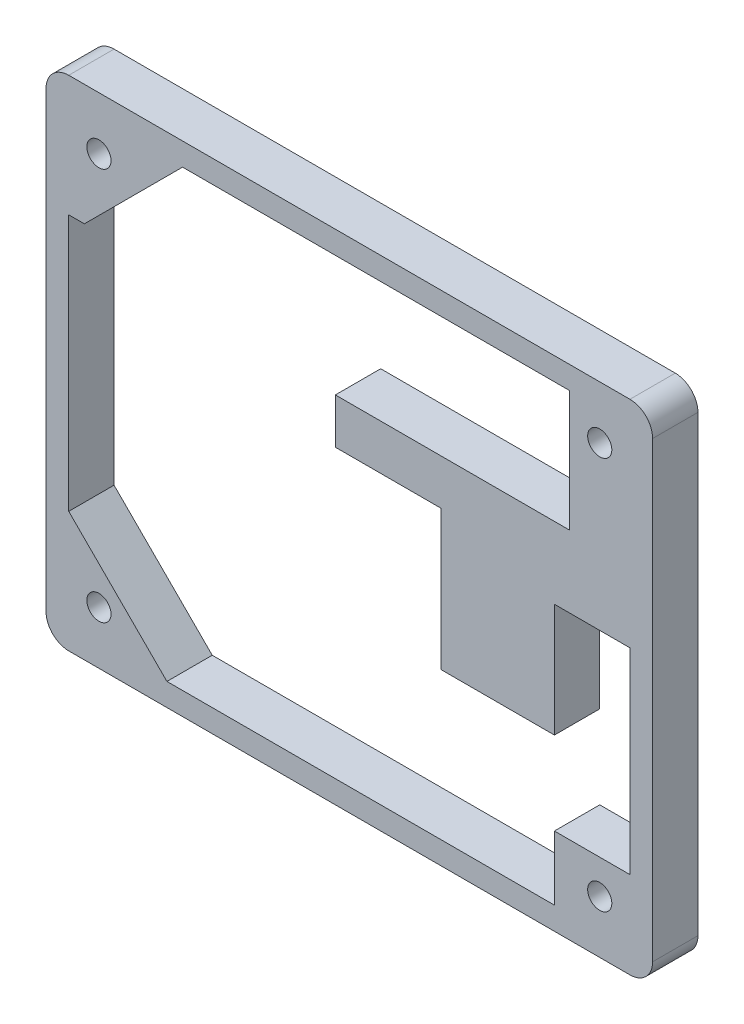
ISO-10303-21;
HEADER;
FILE_DESCRIPTION(('STEP AP214'),'2;1');
FILE_NAME('part.step','',(''),(''),'','','');
FILE_SCHEMA(('AUTOMOTIVE_DESIGN { 1 0 10303 214 1 1 1 1 }'));
ENDSEC;
DATA;
#1=APPLICATION_CONTEXT('core data for automotive mechanical design processes');
#2=APPLICATION_PROTOCOL_DEFINITION('international standard','automotive_design',2000,#1);
#3=PRODUCT_CONTEXT('',#1,'mechanical');
#4=PRODUCT('Part','Part','',(#3));
#5=PRODUCT_RELATED_PRODUCT_CATEGORY('part','',(#4));
#6=PRODUCT_DEFINITION_FORMATION('','',#4);
#7=PRODUCT_DEFINITION_CONTEXT('part definition',#1,'design');
#8=PRODUCT_DEFINITION('design','',#6,#7);
#9=PRODUCT_DEFINITION_SHAPE('','',#8);
#10=(LENGTH_UNIT() NAMED_UNIT(*) SI_UNIT(.MILLI.,.METRE.));
#11=(NAMED_UNIT(*) PLANE_ANGLE_UNIT() SI_UNIT($,.RADIAN.));
#12=(NAMED_UNIT(*) SI_UNIT($,.STERADIAN.) SOLID_ANGLE_UNIT());
#13=UNCERTAINTY_MEASURE_WITH_UNIT(LENGTH_MEASURE(1.E-05),#10,'distance_accuracy_value','');
#14=(GEOMETRIC_REPRESENTATION_CONTEXT(3) GLOBAL_UNCERTAINTY_ASSIGNED_CONTEXT((#13)) GLOBAL_UNIT_ASSIGNED_CONTEXT((#10,
#11,#12)) REPRESENTATION_CONTEXT('',''));
#15=CARTESIAN_POINT('',(0.,0.,0.));
#16=DIRECTION('',(0.,0.,1.));
#17=DIRECTION('',(1.,0.,0.));
#18=AXIS2_PLACEMENT_3D('',#15,#16,#17);
#19=CARTESIAN_POINT('',(0.,0.,6.));
#20=DIRECTION('',(1.,0.,0.));
#21=DIRECTION('',(0.,0.,-1.));
#22=AXIS2_PLACEMENT_3D('',#19,#20,#21);
#23=PLANE('',#22);
#24=DIRECTION('',(0.,-1.,0.));
#25=VECTOR('',#24,1.);
#26=CARTESIAN_POINT('',(0.,0.,0.));
#27=LINE('',#26,#25);
#28=CARTESIAN_POINT('',(0.,63.,0.));
#29=VERTEX_POINT('',#28);
#30=CARTESIAN_POINT('',(0.,3.,0.));
#31=VERTEX_POINT('',#30);
#32=EDGE_CURVE('E322',#29,#31,#27,.T.);
#33=ORIENTED_EDGE('',*,*,#32,.T.);
#34=DIRECTION('',(0.,0.,-1.));
#35=VECTOR('',#34,1.);
#36=CARTESIAN_POINT('',(0.,3.,6.));
#37=LINE('',#36,#35);
#38=CARTESIAN_POINT('',(0.,3.,6.));
#39=VERTEX_POINT('',#38);
#40=EDGE_CURVE('E11',#31,#39,#37,.F.);
#41=ORIENTED_EDGE('',*,*,#40,.T.);
#42=DIRECTION('',(0.,-1.,0.));
#43=VECTOR('',#42,1.);
#44=CARTESIAN_POINT('',(0.,0.,6.));
#45=LINE('',#44,#43);
#46=CARTESIAN_POINT('',(0.,63.,6.));
#47=VERTEX_POINT('',#46);
#48=EDGE_CURVE('E323',#47,#39,#45,.T.);
#49=ORIENTED_EDGE('',*,*,#48,.F.);
#50=DIRECTION('',(0.,0.,-1.));
#51=VECTOR('',#50,1.);
#52=CARTESIAN_POINT('',(0.,63.,6.));
#53=LINE('',#52,#51);
#54=EDGE_CURVE('E40',#47,#29,#53,.T.);
#55=ORIENTED_EDGE('',*,*,#54,.T.);
#56=EDGE_LOOP('',(#33,#41,#49,#55));
#57=FACE_BOUND('',#56,.T.);
#58=ADVANCED_FACE('F32',(#57),#23,.F.);
#59=CARTESIAN_POINT('',(0.,0.,6.));
#60=DIRECTION('',(0.,1.,0.));
#61=DIRECTION('',(0.,0.,1.));
#62=AXIS2_PLACEMENT_3D('',#59,#60,#61);
#63=PLANE('',#62);
#64=DIRECTION('',(1.,0.,0.));
#65=VECTOR('',#64,1.);
#66=CARTESIAN_POINT('',(0.,0.,0.));
#67=LINE('',#66,#65);
#68=CARTESIAN_POINT('',(3.,0.,0.));
#69=VERTEX_POINT('',#68);
#70=CARTESIAN_POINT('',(77.3,0.,0.));
#71=VERTEX_POINT('',#70);
#72=EDGE_CURVE('E339',#69,#71,#67,.T.);
#73=ORIENTED_EDGE('',*,*,#72,.T.);
#74=DIRECTION('',(0.,0.,-1.));
#75=VECTOR('',#74,1.);
#76=CARTESIAN_POINT('',(77.3,0.,6.));
#77=LINE('',#76,#75);
#78=CARTESIAN_POINT('',(77.3,0.,6.));
#79=VERTEX_POINT('',#78);
#80=EDGE_CURVE('E375',#71,#79,#77,.F.);
#81=ORIENTED_EDGE('',*,*,#80,.T.);
#82=DIRECTION('',(1.,0.,0.));
#83=VECTOR('',#82,1.);
#84=CARTESIAN_POINT('',(0.,0.,6.));
#85=LINE('',#84,#83);
#86=CARTESIAN_POINT('',(3.,0.,6.));
#87=VERTEX_POINT('',#86);
#88=EDGE_CURVE('E326',#87,#79,#85,.T.);
#89=ORIENTED_EDGE('',*,*,#88,.F.);
#90=DIRECTION('',(0.,0.,-1.));
#91=VECTOR('',#90,1.);
#92=CARTESIAN_POINT('',(3.,0.,6.));
#93=LINE('',#92,#91);
#94=EDGE_CURVE('E372',#87,#69,#93,.T.);
#95=ORIENTED_EDGE('',*,*,#94,.T.);
#96=EDGE_LOOP('',(#73,#81,#89,#95));
#97=FACE_BOUND('',#96,.T.);
#98=ADVANCED_FACE('F393',(#97),#63,.F.);
#99=CARTESIAN_POINT('',(80.3,0.,6.));
#100=DIRECTION('',(-1.,0.,0.));
#101=DIRECTION('',(0.,0.,1.));
#102=AXIS2_PLACEMENT_3D('',#99,#100,#101);
#103=PLANE('',#102);
#104=DIRECTION('',(0.,1.,0.));
#105=VECTOR('',#104,1.);
#106=CARTESIAN_POINT('',(80.3,0.,0.));
#107=LINE('',#106,#105);
#108=CARTESIAN_POINT('',(80.3,3.,0.));
#109=VERTEX_POINT('',#108);
#110=CARTESIAN_POINT('',(80.3,63.,0.));
#111=VERTEX_POINT('',#110);
#112=EDGE_CURVE('E342',#109,#111,#107,.T.);
#113=ORIENTED_EDGE('',*,*,#112,.T.);
#114=DIRECTION('',(0.,0.,-1.));
#115=VECTOR('',#114,1.);
#116=CARTESIAN_POINT('',(80.3,63.,6.));
#117=LINE('',#116,#115);
#118=CARTESIAN_POINT('',(80.3,63.,6.));
#119=VERTEX_POINT('',#118);
#120=EDGE_CURVE('E362',#111,#119,#117,.F.);
#121=ORIENTED_EDGE('',*,*,#120,.T.);
#122=DIRECTION('',(0.,1.,0.));
#123=VECTOR('',#122,1.);
#124=CARTESIAN_POINT('',(80.3,0.,6.));
#125=LINE('',#124,#123);
#126=CARTESIAN_POINT('',(80.3,3.,6.));
#127=VERTEX_POINT('',#126);
#128=EDGE_CURVE('E330',#127,#119,#125,.T.);
#129=ORIENTED_EDGE('',*,*,#128,.F.);
#130=DIRECTION('',(0.,0.,-1.));
#131=VECTOR('',#130,1.);
#132=CARTESIAN_POINT('',(80.3,3.,6.));
#133=LINE('',#132,#131);
#134=EDGE_CURVE('E359',#127,#109,#133,.T.);
#135=ORIENTED_EDGE('',*,*,#134,.T.);
#136=EDGE_LOOP('',(#113,#121,#129,#135));
#137=FACE_BOUND('',#136,.T.);
#138=ADVANCED_FACE('F404',(#137),#103,.F.);
#139=CARTESIAN_POINT('',(0.,66.,6.));
#140=DIRECTION('',(0.,-1.,0.));
#141=DIRECTION('',(0.,0.,-1.));
#142=AXIS2_PLACEMENT_3D('',#139,#140,#141);
#143=PLANE('',#142);
#144=DIRECTION('',(-1.,0.,0.));
#145=VECTOR('',#144,1.);
#146=CARTESIAN_POINT('',(0.,66.,6.));
#147=LINE('',#146,#145);
#148=CARTESIAN_POINT('',(77.3,66.,6.));
#149=VERTEX_POINT('',#148);
#150=CARTESIAN_POINT('',(3.,66.,6.));
#151=VERTEX_POINT('',#150);
#152=EDGE_CURVE('E333',#149,#151,#147,.T.);
#153=ORIENTED_EDGE('',*,*,#152,.F.);
#154=DIRECTION('',(0.,0.,-1.));
#155=VECTOR('',#154,1.);
#156=CARTESIAN_POINT('',(77.3,66.,6.));
#157=LINE('',#156,#155);
#158=CARTESIAN_POINT('',(77.3,66.,0.));
#159=VERTEX_POINT('',#158);
#160=EDGE_CURVE('E348',#149,#159,#157,.T.);
#161=ORIENTED_EDGE('',*,*,#160,.T.);
#162=DIRECTION('',(-1.,0.,0.));
#163=VECTOR('',#162,1.);
#164=CARTESIAN_POINT('',(0.,66.,0.));
#165=LINE('',#164,#163);
#166=CARTESIAN_POINT('',(3.,66.,0.));
#167=VERTEX_POINT('',#166);
#168=EDGE_CURVE('E327',#159,#167,#165,.T.);
#169=ORIENTED_EDGE('',*,*,#168,.T.);
#170=DIRECTION('',(0.,0.,-1.));
#171=VECTOR('',#170,1.);
#172=CARTESIAN_POINT('',(3.,66.,6.));
#173=LINE('',#172,#171);
#174=EDGE_CURVE('E336',#167,#151,#173,.F.);
#175=ORIENTED_EDGE('',*,*,#174,.T.);
#176=EDGE_LOOP('',(#153,#161,#169,#175));
#177=FACE_BOUND('',#176,.T.);
#178=ADVANCED_FACE('F412',(#177),#143,.F.);
#179=CARTESIAN_POINT('',(0.,0.,6.));
#180=DIRECTION('',(0.,0.,-1.));
#181=DIRECTION('',(-1.,0.,0.));
#182=AXIS2_PLACEMENT_3D('',#179,#180,#181);
#183=PLANE('',#182);
#184=DIRECTION('',(1.,0.,0.));
#185=VECTOR('',#184,1.);
#186=CARTESIAN_POINT('',(77.3,11.5,6.));
#187=LINE('',#186,#185);
#188=CARTESIAN_POINT('',(67.3,11.5,6.));
#189=VERTEX_POINT('',#188);
#190=CARTESIAN_POINT('',(77.3,11.5,6.));
#191=VERTEX_POINT('',#190);
#192=EDGE_CURVE('E239',#189,#191,#187,.T.);
#193=ORIENTED_EDGE('',*,*,#192,.F.);
#194=DIRECTION('',(0.,1.,0.));
#195=VECTOR('',#194,1.);
#196=CARTESIAN_POINT('',(67.3,11.5,6.));
#197=LINE('',#196,#195);
#198=CARTESIAN_POINT('',(67.3,3.,6.));
#199=VERTEX_POINT('',#198);
#200=EDGE_CURVE('E760',#199,#189,#197,.T.);
#201=ORIENTED_EDGE('',*,*,#200,.F.);
#202=DIRECTION('',(1.,0.,0.));
#203=VECTOR('',#202,1.);
#204=CARTESIAN_POINT('',(25.8293559072506,3.,6.));
#205=LINE('',#204,#203);
#206=CARTESIAN_POINT('',(16.0000000000002,2.99999999999999,6.));
#207=VERTEX_POINT('',#206);
#208=EDGE_CURVE('E765',#207,#199,#205,.T.);
#209=ORIENTED_EDGE('',*,*,#208,.F.);
#210=DIRECTION('',(0.707106781186552,-0.707106781186543,0.));
#211=VECTOR('',#210,1.);
#212=CARTESIAN_POINT('',(16.0000000000002,2.99999999999999,6.));
#213=LINE('',#212,#211);
#214=CARTESIAN_POINT('',(3.,16.,6.));
#215=VERTEX_POINT('',#214);
#216=EDGE_CURVE('E734',#215,#207,#213,.T.);
#217=ORIENTED_EDGE('',*,*,#216,.F.);
#218=DIRECTION('',(0.,-1.,0.));
#219=VECTOR('',#218,1.);
#220=CARTESIAN_POINT('',(3.,16.,6.));
#221=LINE('',#220,#219);
#222=CARTESIAN_POINT('',(3.,50.,6.));
#223=VERTEX_POINT('',#222);
#224=EDGE_CURVE('E278',#223,#215,#221,.T.);
#225=ORIENTED_EDGE('',*,*,#224,.F.);
#226=DIRECTION('',(-1.,0.,0.));
#227=VECTOR('',#226,1.);
#228=CARTESIAN_POINT('',(3.,50.,6.));
#229=LINE('',#228,#227);
#230=CARTESIAN_POINT('',(5.07106781186543,50.,6.));
#231=VERTEX_POINT('',#230);
#232=EDGE_CURVE('E288',#231,#223,#229,.T.);
#233=ORIENTED_EDGE('',*,*,#232,.F.);
#234=DIRECTION('',(-0.707106781186551,-0.707106781186544,0.));
#235=VECTOR('',#234,1.);
#236=CARTESIAN_POINT('',(5.07106781186543,50.,6.));
#237=LINE('',#236,#235);
#238=CARTESIAN_POINT('',(18.0710678118656,63.,6.));
#239=VERTEX_POINT('',#238);
#240=EDGE_CURVE('E725',#239,#231,#237,.T.);
#241=ORIENTED_EDGE('',*,*,#240,.F.);
#242=DIRECTION('',(-1.,0.,0.));
#243=VECTOR('',#242,1.);
#244=CARTESIAN_POINT('',(69.3,63.,6.));
#245=LINE('',#244,#243);
#246=CARTESIAN_POINT('',(69.3,63.,6.));
#247=VERTEX_POINT('',#246);
#248=EDGE_CURVE('E272',#247,#239,#245,.T.);
#249=ORIENTED_EDGE('',*,*,#248,.F.);
#250=DIRECTION('',(0.,1.,0.));
#251=VECTOR('',#250,1.);
#252=CARTESIAN_POINT('',(69.3,63.,6.));
#253=LINE('',#252,#251);
#254=CARTESIAN_POINT('',(69.3,47.,6.));
#255=VERTEX_POINT('',#254);
#256=EDGE_CURVE('E260',#255,#247,#253,.T.);
#257=ORIENTED_EDGE('',*,*,#256,.F.);
#258=DIRECTION('',(1.,0.,0.));
#259=VECTOR('',#258,1.);
#260=CARTESIAN_POINT('',(69.3,47.,6.));
#261=LINE('',#260,#259);
#262=CARTESIAN_POINT('',(38.3,47.,6.));
#263=VERTEX_POINT('',#262);
#264=EDGE_CURVE('E265',#263,#255,#261,.T.);
#265=ORIENTED_EDGE('',*,*,#264,.F.);
#266=DIRECTION('',(0.,1.,0.));
#267=VECTOR('',#266,1.);
#268=CARTESIAN_POINT('',(38.3,47.,6.));
#269=LINE('',#268,#267);
#270=CARTESIAN_POINT('',(38.3,41.,6.));
#271=VERTEX_POINT('',#270);
#272=EDGE_CURVE('E735',#271,#263,#269,.T.);
#273=ORIENTED_EDGE('',*,*,#272,.F.);
#274=DIRECTION('',(-1.,0.,0.));
#275=VECTOR('',#274,1.);
#276=CARTESIAN_POINT('',(52.3,41.,6.));
#277=LINE('',#276,#275);
#278=CARTESIAN_POINT('',(52.3,41.,6.));
#279=VERTEX_POINT('',#278);
#280=EDGE_CURVE('E253',#279,#271,#277,.T.);
#281=ORIENTED_EDGE('',*,*,#280,.F.);
#282=DIRECTION('',(0.,1.,0.));
#283=VECTOR('',#282,1.);
#284=CARTESIAN_POINT('',(52.3,41.,6.));
#285=LINE('',#284,#283);
#286=CARTESIAN_POINT('',(52.3,22.5,6.));
#287=VERTEX_POINT('',#286);
#288=EDGE_CURVE('E244',#287,#279,#285,.T.);
#289=ORIENTED_EDGE('',*,*,#288,.F.);
#290=DIRECTION('',(-1.,0.,0.));
#291=VECTOR('',#290,1.);
#292=CARTESIAN_POINT('',(25.8293559072506,22.5,6.));
#293=LINE('',#292,#291);
#294=CARTESIAN_POINT('',(67.3,22.5,6.));
#295=VERTEX_POINT('',#294);
#296=EDGE_CURVE('E773',#295,#287,#293,.T.);
#297=ORIENTED_EDGE('',*,*,#296,.F.);
#298=DIRECTION('',(0.,-1.,0.));
#299=VECTOR('',#298,1.);
#300=CARTESIAN_POINT('',(67.3,37.5,6.));
#301=LINE('',#300,#299);
#302=CARTESIAN_POINT('',(67.3,37.5,6.));
#303=VERTEX_POINT('',#302);
#304=EDGE_CURVE('E215',#303,#295,#301,.T.);
#305=ORIENTED_EDGE('',*,*,#304,.F.);
#306=DIRECTION('',(-1.,0.,0.));
#307=VECTOR('',#306,1.);
#308=CARTESIAN_POINT('',(77.3,37.5,6.));
#309=LINE('',#308,#307);
#310=CARTESIAN_POINT('',(77.3,37.5,6.));
#311=VERTEX_POINT('',#310);
#312=EDGE_CURVE('E235',#311,#303,#309,.T.);
#313=ORIENTED_EDGE('',*,*,#312,.F.);
#314=DIRECTION('',(0.,1.,0.));
#315=VECTOR('',#314,1.);
#316=CARTESIAN_POINT('',(77.3,37.5,6.));
#317=LINE('',#316,#315);
#318=EDGE_CURVE('E55',#191,#311,#317,.T.);
#319=ORIENTED_EDGE('',*,*,#318,.F.);
#320=EDGE_LOOP('',(#193,#201,#209,#217,#225,#233,#241,#249,#257,#265,#273,#281,#289,#297,#305,
#313,#319));
#321=FACE_BOUND('',#320,.T.);
#322=CARTESIAN_POINT('',(7.,59.,6.));
#323=DIRECTION('',(0.,0.,1.));
#324=DIRECTION('',(1.,0.,0.));
#325=AXIS2_PLACEMENT_3D('',#322,#323,#324);
#326=CIRCLE('',#325,1.59999999999999);
#327=CARTESIAN_POINT('',(8.59999999999999,59.,6.));
#328=VERTEX_POINT('',#327);
#329=EDGE_CURVE('E297',#328,#328,#326,.T.);
#330=ORIENTED_EDGE('',*,*,#329,.F.);
#331=EDGE_LOOP('',(#330));
#332=FACE_BOUND('',#331,.T.);
#333=CARTESIAN_POINT('',(73.3,59.,6.));
#334=DIRECTION('',(0.,0.,1.));
#335=DIRECTION('',(1.,0.,0.));
#336=AXIS2_PLACEMENT_3D('',#333,#334,#335);
#337=CIRCLE('',#336,1.59999999999999);
#338=CARTESIAN_POINT('',(74.9,59.,6.));
#339=VERTEX_POINT('',#338);
#340=EDGE_CURVE('E304',#339,#339,#337,.T.);
#341=ORIENTED_EDGE('',*,*,#340,.F.);
#342=EDGE_LOOP('',(#341));
#343=FACE_BOUND('',#342,.T.);
#344=CARTESIAN_POINT('',(73.3,7.,6.));
#345=DIRECTION('',(0.,0.,1.));
#346=DIRECTION('',(1.,0.,0.));
#347=AXIS2_PLACEMENT_3D('',#344,#345,#346);
#348=CIRCLE('',#347,1.59999999999999);
#349=CARTESIAN_POINT('',(74.9,7.,6.));
#350=VERTEX_POINT('',#349);
#351=EDGE_CURVE('E310',#350,#350,#348,.T.);
#352=ORIENTED_EDGE('',*,*,#351,.F.);
#353=EDGE_LOOP('',(#352));
#354=FACE_BOUND('',#353,.T.);
#355=CARTESIAN_POINT('',(7.00000000000001,7.,6.));
#356=DIRECTION('',(0.,0.,1.));
#357=DIRECTION('',(1.,0.,0.));
#358=AXIS2_PLACEMENT_3D('',#355,#356,#357);
#359=CIRCLE('',#358,1.59999999999999);
#360=CARTESIAN_POINT('',(8.59999999999999,7.,6.));
#361=VERTEX_POINT('',#360);
#362=EDGE_CURVE('E316',#361,#361,#359,.T.);
#363=ORIENTED_EDGE('',*,*,#362,.F.);
#364=EDGE_LOOP('',(#363));
#365=FACE_BOUND('',#364,.T.);
#366=ORIENTED_EDGE('',*,*,#128,.T.);
#367=CARTESIAN_POINT('',(77.3,63.,6.));
#368=DIRECTION('',(0.,0.,-1.));
#369=DIRECTION('',(-1.,0.,0.));
#370=AXIS2_PLACEMENT_3D('',#367,#368,#369);
#371=CIRCLE('',#370,3.);
#372=EDGE_CURVE('E370',#119,#149,#371,.F.);
#373=ORIENTED_EDGE('',*,*,#372,.T.);
#374=ORIENTED_EDGE('',*,*,#152,.T.);
#375=CARTESIAN_POINT('',(3.,63.,6.));
#376=DIRECTION('',(0.,0.,-1.));
#377=DIRECTION('',(-1.,0.,0.));
#378=AXIS2_PLACEMENT_3D('',#375,#376,#377);
#379=CIRCLE('',#378,3.);
#380=EDGE_CURVE('E364',#151,#47,#379,.F.);
#381=ORIENTED_EDGE('',*,*,#380,.T.);
#382=ORIENTED_EDGE('',*,*,#48,.T.);
#383=CARTESIAN_POINT('',(3.,3.,6.));
#384=DIRECTION('',(0.,0.,-1.));
#385=DIRECTION('',(-1.,0.,0.));
#386=AXIS2_PLACEMENT_3D('',#383,#384,#385);
#387=CIRCLE('',#386,3.);
#388=EDGE_CURVE('E366',#39,#87,#387,.F.);
#389=ORIENTED_EDGE('',*,*,#388,.T.);
#390=ORIENTED_EDGE('',*,*,#88,.T.);
#391=CARTESIAN_POINT('',(77.3,3.,6.));
#392=DIRECTION('',(0.,0.,-1.));
#393=DIRECTION('',(-1.,0.,0.));
#394=AXIS2_PLACEMENT_3D('',#391,#392,#393);
#395=CIRCLE('',#394,3.);
#396=EDGE_CURVE('E368',#79,#127,#395,.F.);
#397=ORIENTED_EDGE('',*,*,#396,.T.);
#398=EDGE_LOOP('',(#366,#373,#374,#381,#382,#389,#390,#397));
#399=FACE_BOUND('',#398,.T.);
#400=ADVANCED_FACE('F397',(#321,#332,#343,#354,#365,#399),#183,.F.);
#401=CARTESIAN_POINT('',(0.,0.,0.));
#402=DIRECTION('',(0.,0.,-1.));
#403=DIRECTION('',(-1.,0.,0.));
#404=AXIS2_PLACEMENT_3D('',#401,#402,#403);
#405=PLANE('',#404);
#406=DIRECTION('',(0.,1.,0.));
#407=VECTOR('',#406,1.);
#408=CARTESIAN_POINT('',(67.3,22.5,0.));
#409=LINE('',#408,#407);
#410=CARTESIAN_POINT('',(67.3,3.,0.));
#411=VERTEX_POINT('',#410);
#412=CARTESIAN_POINT('',(67.3,11.5,0.));
#413=VERTEX_POINT('',#412);
#414=EDGE_CURVE('E754',#411,#413,#409,.T.);
#415=ORIENTED_EDGE('',*,*,#414,.T.);
#416=DIRECTION('',(1.,0.,0.));
#417=VECTOR('',#416,1.);
#418=CARTESIAN_POINT('',(77.3,11.5,0.));
#419=LINE('',#418,#417);
#420=CARTESIAN_POINT('',(77.3,11.5,0.));
#421=VERTEX_POINT('',#420);
#422=EDGE_CURVE('E225',#413,#421,#419,.T.);
#423=ORIENTED_EDGE('',*,*,#422,.T.);
#424=DIRECTION('',(0.,1.,0.));
#425=VECTOR('',#424,1.);
#426=CARTESIAN_POINT('',(77.3,37.5,0.));
#427=LINE('',#426,#425);
#428=CARTESIAN_POINT('',(77.3,37.5,0.));
#429=VERTEX_POINT('',#428);
#430=EDGE_CURVE('E230',#421,#429,#427,.T.);
#431=ORIENTED_EDGE('',*,*,#430,.T.);
#432=DIRECTION('',(-1.,0.,0.));
#433=VECTOR('',#432,1.);
#434=CARTESIAN_POINT('',(77.3,37.5,0.));
#435=LINE('',#434,#433);
#436=CARTESIAN_POINT('',(67.3,37.5,0.));
#437=VERTEX_POINT('',#436);
#438=EDGE_CURVE('E224',#429,#437,#435,.T.);
#439=ORIENTED_EDGE('',*,*,#438,.T.);
#440=DIRECTION('',(0.,-1.,0.));
#441=VECTOR('',#440,1.);
#442=CARTESIAN_POINT('',(67.3,37.5,0.));
#443=LINE('',#442,#441);
#444=CARTESIAN_POINT('',(67.3,22.5,0.));
#445=VERTEX_POINT('',#444);
#446=EDGE_CURVE('E212',#437,#445,#443,.T.);
#447=ORIENTED_EDGE('',*,*,#446,.T.);
#448=DIRECTION('',(-1.,0.,0.));
#449=VECTOR('',#448,1.);
#450=CARTESIAN_POINT('',(25.8293559072506,22.5,0.));
#451=LINE('',#450,#449);
#452=CARTESIAN_POINT('',(52.3,22.5,0.));
#453=VERTEX_POINT('',#452);
#454=EDGE_CURVE('E199',#445,#453,#451,.T.);
#455=ORIENTED_EDGE('',*,*,#454,.T.);
#456=DIRECTION('',(0.,1.,0.));
#457=VECTOR('',#456,1.);
#458=CARTESIAN_POINT('',(52.3,41.,0.));
#459=LINE('',#458,#457);
#460=CARTESIAN_POINT('',(52.3,41.,0.));
#461=VERTEX_POINT('',#460);
#462=EDGE_CURVE('E47',#453,#461,#459,.T.);
#463=ORIENTED_EDGE('',*,*,#462,.T.);
#464=DIRECTION('',(-1.,0.,0.));
#465=VECTOR('',#464,1.);
#466=CARTESIAN_POINT('',(52.3,41.,0.));
#467=LINE('',#466,#465);
#468=CARTESIAN_POINT('',(38.3,41.,0.));
#469=VERTEX_POINT('',#468);
#470=EDGE_CURVE('E252',#461,#469,#467,.T.);
#471=ORIENTED_EDGE('',*,*,#470,.T.);
#472=DIRECTION('',(0.,1.,0.));
#473=VECTOR('',#472,1.);
#474=CARTESIAN_POINT('',(38.3,47.,0.));
#475=LINE('',#474,#473);
#476=CARTESIAN_POINT('',(38.3,47.,0.));
#477=VERTEX_POINT('',#476);
#478=EDGE_CURVE('E750',#469,#477,#475,.T.);
#479=ORIENTED_EDGE('',*,*,#478,.T.);
#480=DIRECTION('',(1.,0.,0.));
#481=VECTOR('',#480,1.);
#482=CARTESIAN_POINT('',(69.3,47.,0.));
#483=LINE('',#482,#481);
#484=CARTESIAN_POINT('',(69.3,47.,0.));
#485=VERTEX_POINT('',#484);
#486=EDGE_CURVE('E267',#477,#485,#483,.T.);
#487=ORIENTED_EDGE('',*,*,#486,.T.);
#488=DIRECTION('',(0.,1.,0.));
#489=VECTOR('',#488,1.);
#490=CARTESIAN_POINT('',(69.3,63.,0.));
#491=LINE('',#490,#489);
#492=CARTESIAN_POINT('',(69.3,63.,0.));
#493=VERTEX_POINT('',#492);
#494=EDGE_CURVE('E261',#485,#493,#491,.T.);
#495=ORIENTED_EDGE('',*,*,#494,.T.);
#496=DIRECTION('',(-1.,0.,0.));
#497=VECTOR('',#496,1.);
#498=CARTESIAN_POINT('',(69.3,63.,0.));
#499=LINE('',#498,#497);
#500=CARTESIAN_POINT('',(18.0710678118656,63.,0.));
#501=VERTEX_POINT('',#500);
#502=EDGE_CURVE('E264',#493,#501,#499,.T.);
#503=ORIENTED_EDGE('',*,*,#502,.T.);
#504=DIRECTION('',(-0.707106781186551,-0.707106781186544,0.));
#505=VECTOR('',#504,1.);
#506=CARTESIAN_POINT('',(5.07106781186543,50.,0.));
#507=LINE('',#506,#505);
#508=CARTESIAN_POINT('',(5.07106781186543,50.,0.));
#509=VERTEX_POINT('',#508);
#510=EDGE_CURVE('E748',#501,#509,#507,.T.);
#511=ORIENTED_EDGE('',*,*,#510,.T.);
#512=DIRECTION('',(-1.,0.,0.));
#513=VECTOR('',#512,1.);
#514=CARTESIAN_POINT('',(3.,50.,0.));
#515=LINE('',#514,#513);
#516=CARTESIAN_POINT('',(3.,50.,0.));
#517=VERTEX_POINT('',#516);
#518=EDGE_CURVE('E287',#509,#517,#515,.T.);
#519=ORIENTED_EDGE('',*,*,#518,.T.);
#520=DIRECTION('',(0.,-1.,0.));
#521=VECTOR('',#520,1.);
#522=CARTESIAN_POINT('',(3.,16.,0.));
#523=LINE('',#522,#521);
#524=CARTESIAN_POINT('',(3.,16.,0.));
#525=VERTEX_POINT('',#524);
#526=EDGE_CURVE('E284',#517,#525,#523,.T.);
#527=ORIENTED_EDGE('',*,*,#526,.T.);
#528=DIRECTION('',(0.707106781186552,-0.707106781186543,0.));
#529=VECTOR('',#528,1.);
#530=CARTESIAN_POINT('',(16.0000000000002,2.99999999999999,0.));
#531=LINE('',#530,#529);
#532=CARTESIAN_POINT('',(16.0000000000002,2.99999999999999,0.));
#533=VERTEX_POINT('',#532);
#534=EDGE_CURVE('E216',#525,#533,#531,.T.);
#535=ORIENTED_EDGE('',*,*,#534,.T.);
#536=DIRECTION('',(1.,0.,0.));
#537=VECTOR('',#536,1.);
#538=CARTESIAN_POINT('',(25.8293559072506,3.,0.));
#539=LINE('',#538,#537);
#540=EDGE_CURVE('E208',#533,#411,#539,.T.);
#541=ORIENTED_EDGE('',*,*,#540,.T.);
#542=EDGE_LOOP('',(#415,#423,#431,#439,#447,#455,#463,#471,#479,#487,#495,#503,#511,#519,#527,
#535,#541));
#543=FACE_BOUND('',#542,.T.);
#544=CARTESIAN_POINT('',(7.,59.,0.));
#545=DIRECTION('',(0.,0.,1.));
#546=DIRECTION('',(1.,0.,0.));
#547=AXIS2_PLACEMENT_3D('',#544,#545,#546);
#548=CIRCLE('',#547,1.6);
#549=CARTESIAN_POINT('',(8.6,59.,0.));
#550=VERTEX_POINT('',#549);
#551=EDGE_CURVE('E301',#550,#550,#548,.T.);
#552=ORIENTED_EDGE('',*,*,#551,.T.);
#553=EDGE_LOOP('',(#552));
#554=FACE_BOUND('',#553,.T.);
#555=CARTESIAN_POINT('',(73.3,59.,0.));
#556=DIRECTION('',(0.,0.,1.));
#557=DIRECTION('',(1.,0.,0.));
#558=AXIS2_PLACEMENT_3D('',#555,#556,#557);
#559=CIRCLE('',#558,1.6);
#560=CARTESIAN_POINT('',(74.9,59.,0.));
#561=VERTEX_POINT('',#560);
#562=EDGE_CURVE('E307',#561,#561,#559,.T.);
#563=ORIENTED_EDGE('',*,*,#562,.T.);
#564=EDGE_LOOP('',(#563));
#565=FACE_BOUND('',#564,.T.);
#566=CARTESIAN_POINT('',(73.3,7.,0.));
#567=DIRECTION('',(0.,0.,1.));
#568=DIRECTION('',(1.,0.,0.));
#569=AXIS2_PLACEMENT_3D('',#566,#567,#568);
#570=CIRCLE('',#569,1.6);
#571=CARTESIAN_POINT('',(74.9,7.,0.));
#572=VERTEX_POINT('',#571);
#573=EDGE_CURVE('E313',#572,#572,#570,.T.);
#574=ORIENTED_EDGE('',*,*,#573,.T.);
#575=EDGE_LOOP('',(#574));
#576=FACE_BOUND('',#575,.T.);
#577=CARTESIAN_POINT('',(7.00000000000001,7.,0.));
#578=DIRECTION('',(0.,0.,1.));
#579=DIRECTION('',(1.,0.,0.));
#580=AXIS2_PLACEMENT_3D('',#577,#578,#579);
#581=CIRCLE('',#580,1.6);
#582=CARTESIAN_POINT('',(8.6,7.,0.));
#583=VERTEX_POINT('',#582);
#584=EDGE_CURVE('E319',#583,#583,#581,.T.);
#585=ORIENTED_EDGE('',*,*,#584,.T.);
#586=EDGE_LOOP('',(#585));
#587=FACE_BOUND('',#586,.T.);
#588=ORIENTED_EDGE('',*,*,#168,.F.);
#589=CARTESIAN_POINT('',(77.3,63.,0.));
#590=DIRECTION('',(0.,0.,-1.));
#591=DIRECTION('',(-1.,0.,0.));
#592=AXIS2_PLACEMENT_3D('',#589,#590,#591);
#593=CIRCLE('',#592,3.);
#594=EDGE_CURVE('E357',#159,#111,#593,.T.);
#595=ORIENTED_EDGE('',*,*,#594,.T.);
#596=ORIENTED_EDGE('',*,*,#112,.F.);
#597=CARTESIAN_POINT('',(77.3,3.,0.));
#598=DIRECTION('',(0.,0.,-1.));
#599=DIRECTION('',(-1.,0.,0.));
#600=AXIS2_PLACEMENT_3D('',#597,#598,#599);
#601=CIRCLE('',#600,3.);
#602=EDGE_CURVE('E355',#109,#71,#601,.T.);
#603=ORIENTED_EDGE('',*,*,#602,.T.);
#604=ORIENTED_EDGE('',*,*,#72,.F.);
#605=CARTESIAN_POINT('',(3.,3.,0.));
#606=DIRECTION('',(0.,0.,-1.));
#607=DIRECTION('',(-1.,0.,0.));
#608=AXIS2_PLACEMENT_3D('',#605,#606,#607);
#609=CIRCLE('',#608,3.);
#610=EDGE_CURVE('E353',#69,#31,#609,.T.);
#611=ORIENTED_EDGE('',*,*,#610,.T.);
#612=ORIENTED_EDGE('',*,*,#32,.F.);
#613=CARTESIAN_POINT('',(3.,63.,0.));
#614=DIRECTION('',(0.,0.,-1.));
#615=DIRECTION('',(-1.,0.,0.));
#616=AXIS2_PLACEMENT_3D('',#613,#614,#615);
#617=CIRCLE('',#616,3.);
#618=EDGE_CURVE('E351',#29,#167,#617,.T.);
#619=ORIENTED_EDGE('',*,*,#618,.T.);
#620=EDGE_LOOP('',(#588,#595,#596,#603,#604,#611,#612,#619));
#621=FACE_BOUND('',#620,.T.);
#622=ADVANCED_FACE('F220',(#543,#554,#565,#576,#587,#621),#405,.T.);
#623=CARTESIAN_POINT('',(7.00000000000001,7.,6.));
#624=DIRECTION('',(0.,0.,1.));
#625=DIRECTION('',(1.,0.,0.));
#626=AXIS2_PLACEMENT_3D('',#623,#624,#625);
#627=CYLINDRICAL_SURFACE('',#626,1.59999999999999);
#628=ORIENTED_EDGE('',*,*,#584,.F.);
#629=EDGE_LOOP('',(#628));
#630=FACE_BOUND('',#629,.T.);
#631=ORIENTED_EDGE('',*,*,#362,.T.);
#632=EDGE_LOOP('',(#631));
#633=FACE_BOUND('',#632,.T.);
#634=ADVANCED_FACE('F513',(#630,#633),#627,.F.);
#635=CARTESIAN_POINT('',(73.3,7.,6.));
#636=DIRECTION('',(0.,0.,1.));
#637=DIRECTION('',(1.,0.,0.));
#638=AXIS2_PLACEMENT_3D('',#635,#636,#637);
#639=CYLINDRICAL_SURFACE('',#638,1.6);
#640=ORIENTED_EDGE('',*,*,#573,.F.);
#641=EDGE_LOOP('',(#640));
#642=FACE_BOUND('',#641,.T.);
#643=ORIENTED_EDGE('',*,*,#351,.T.);
#644=EDGE_LOOP('',(#643));
#645=FACE_BOUND('',#644,.T.);
#646=ADVANCED_FACE('F646',(#642,#645),#639,.F.);
#647=CARTESIAN_POINT('',(73.3,59.,6.));
#648=DIRECTION('',(0.,0.,1.));
#649=DIRECTION('',(1.,0.,0.));
#650=AXIS2_PLACEMENT_3D('',#647,#648,#649);
#651=CYLINDRICAL_SURFACE('',#650,1.6);
#652=ORIENTED_EDGE('',*,*,#562,.F.);
#653=EDGE_LOOP('',(#652));
#654=FACE_BOUND('',#653,.T.);
#655=ORIENTED_EDGE('',*,*,#340,.T.);
#656=EDGE_LOOP('',(#655));
#657=FACE_BOUND('',#656,.T.);
#658=ADVANCED_FACE('F642',(#654,#657),#651,.F.);
#659=CARTESIAN_POINT('',(7.,59.,6.));
#660=DIRECTION('',(0.,0.,1.));
#661=DIRECTION('',(1.,0.,0.));
#662=AXIS2_PLACEMENT_3D('',#659,#660,#661);
#663=CYLINDRICAL_SURFACE('',#662,1.59999999999999);
#664=ORIENTED_EDGE('',*,*,#551,.F.);
#665=EDGE_LOOP('',(#664));
#666=FACE_BOUND('',#665,.T.);
#667=ORIENTED_EDGE('',*,*,#329,.T.);
#668=EDGE_LOOP('',(#667));
#669=FACE_BOUND('',#668,.T.);
#670=ADVANCED_FACE('F433',(#666,#669),#663,.F.);
#671=CARTESIAN_POINT('',(77.3,63.,6.));
#672=DIRECTION('',(0.,0.,-1.));
#673=DIRECTION('',(-1.,0.,0.));
#674=AXIS2_PLACEMENT_3D('',#671,#672,#673);
#675=CYLINDRICAL_SURFACE('',#674,3.);
#676=ORIENTED_EDGE('',*,*,#372,.F.);
#677=ORIENTED_EDGE('',*,*,#120,.F.);
#678=ORIENTED_EDGE('',*,*,#594,.F.);
#679=ORIENTED_EDGE('',*,*,#160,.F.);
#680=EDGE_LOOP('',(#676,#677,#678,#679));
#681=FACE_BOUND('',#680,.T.);
#682=ADVANCED_FACE('F409',(#681),#675,.T.);
#683=CARTESIAN_POINT('',(77.3,3.,6.));
#684=DIRECTION('',(0.,0.,-1.));
#685=DIRECTION('',(-1.,0.,0.));
#686=AXIS2_PLACEMENT_3D('',#683,#684,#685);
#687=CYLINDRICAL_SURFACE('',#686,3.);
#688=ORIENTED_EDGE('',*,*,#396,.F.);
#689=ORIENTED_EDGE('',*,*,#80,.F.);
#690=ORIENTED_EDGE('',*,*,#602,.F.);
#691=ORIENTED_EDGE('',*,*,#134,.F.);
#692=EDGE_LOOP('',(#688,#689,#690,#691));
#693=FACE_BOUND('',#692,.T.);
#694=ADVANCED_FACE('F401',(#693),#687,.T.);
#695=CARTESIAN_POINT('',(3.,3.,6.));
#696=DIRECTION('',(0.,0.,-1.));
#697=DIRECTION('',(-1.,0.,0.));
#698=AXIS2_PLACEMENT_3D('',#695,#696,#697);
#699=CYLINDRICAL_SURFACE('',#698,3.);
#700=ORIENTED_EDGE('',*,*,#388,.F.);
#701=ORIENTED_EDGE('',*,*,#40,.F.);
#702=ORIENTED_EDGE('',*,*,#610,.F.);
#703=ORIENTED_EDGE('',*,*,#94,.F.);
#704=EDGE_LOOP('',(#700,#701,#702,#703));
#705=FACE_BOUND('',#704,.T.);
#706=ADVANCED_FACE('F390',(#705),#699,.T.);
#707=CARTESIAN_POINT('',(3.,63.,6.));
#708=DIRECTION('',(0.,0.,-1.));
#709=DIRECTION('',(-1.,0.,0.));
#710=AXIS2_PLACEMENT_3D('',#707,#708,#709);
#711=CYLINDRICAL_SURFACE('',#710,3.);
#712=ORIENTED_EDGE('',*,*,#380,.F.);
#713=ORIENTED_EDGE('',*,*,#174,.F.);
#714=ORIENTED_EDGE('',*,*,#618,.F.);
#715=ORIENTED_EDGE('',*,*,#54,.F.);
#716=EDGE_LOOP('',(#712,#713,#714,#715));
#717=FACE_BOUND('',#716,.T.);
#718=ADVANCED_FACE('F34',(#717),#711,.T.);
#719=CARTESIAN_POINT('',(3.,16.,0.));
#720=DIRECTION('',(-1.,0.,0.));
#721=DIRECTION('',(0.,0.,1.));
#722=AXIS2_PLACEMENT_3D('',#719,#720,#721);
#723=PLANE('',#722);
#724=ORIENTED_EDGE('',*,*,#224,.T.);
#725=DIRECTION('',(0.,0.,1.));
#726=VECTOR('',#725,1.);
#727=CARTESIAN_POINT('',(3.,16.,0.));
#728=LINE('',#727,#726);
#729=EDGE_CURVE('E290',#525,#215,#728,.T.);
#730=ORIENTED_EDGE('',*,*,#729,.F.);
#731=ORIENTED_EDGE('',*,*,#526,.F.);
#732=DIRECTION('',(0.,0.,1.));
#733=VECTOR('',#732,1.);
#734=CARTESIAN_POINT('',(3.,50.,0.));
#735=LINE('',#734,#733);
#736=EDGE_CURVE('E294',#517,#223,#735,.T.);
#737=ORIENTED_EDGE('',*,*,#736,.T.);
#738=EDGE_LOOP('',(#724,#730,#731,#737));
#739=FACE_BOUND('',#738,.T.);
#740=ADVANCED_FACE('F415',(#739),#723,.F.);
#741=CARTESIAN_POINT('',(3.,50.,0.));
#742=DIRECTION('',(0.,1.,0.));
#743=DIRECTION('',(0.,0.,1.));
#744=AXIS2_PLACEMENT_3D('',#741,#742,#743);
#745=PLANE('',#744);
#746=ORIENTED_EDGE('',*,*,#518,.F.);
#747=DIRECTION('',(0.,0.,1.));
#748=VECTOR('',#747,1.);
#749=CARTESIAN_POINT('',(5.07106781186543,50.,0.));
#750=LINE('',#749,#748);
#751=EDGE_CURVE('E728',#509,#231,#750,.T.);
#752=ORIENTED_EDGE('',*,*,#751,.T.);
#753=ORIENTED_EDGE('',*,*,#232,.T.);
#754=ORIENTED_EDGE('',*,*,#736,.F.);
#755=EDGE_LOOP('',(#746,#752,#753,#754));
#756=FACE_BOUND('',#755,.T.);
#757=ADVANCED_FACE('F420',(#756),#745,.F.);
#758=CARTESIAN_POINT('',(69.3,63.,0.));
#759=DIRECTION('',(1.,0.,0.));
#760=DIRECTION('',(0.,1.,0.));
#761=AXIS2_PLACEMENT_3D('',#758,#759,#760);
#762=PLANE('',#761);
#763=ORIENTED_EDGE('',*,*,#256,.T.);
#764=DIRECTION('',(0.,0.,1.));
#765=VECTOR('',#764,1.);
#766=CARTESIAN_POINT('',(69.3,63.,0.));
#767=LINE('',#766,#765);
#768=EDGE_CURVE('E270',#493,#247,#767,.T.);
#769=ORIENTED_EDGE('',*,*,#768,.F.);
#770=ORIENTED_EDGE('',*,*,#494,.F.);
#771=DIRECTION('',(0.,0.,1.));
#772=VECTOR('',#771,1.);
#773=CARTESIAN_POINT('',(69.3,47.,0.));
#774=LINE('',#773,#772);
#775=EDGE_CURVE('E276',#485,#255,#774,.T.);
#776=ORIENTED_EDGE('',*,*,#775,.T.);
#777=EDGE_LOOP('',(#763,#769,#770,#776));
#778=FACE_BOUND('',#777,.T.);
#779=ADVANCED_FACE('F454',(#778),#762,.F.);
#780=CARTESIAN_POINT('',(69.3,47.,0.));
#781=DIRECTION('',(0.,-1.,0.));
#782=DIRECTION('',(1.,0.,0.));
#783=AXIS2_PLACEMENT_3D('',#780,#781,#782);
#784=PLANE('',#783);
#785=ORIENTED_EDGE('',*,*,#264,.T.);
#786=ORIENTED_EDGE('',*,*,#775,.F.);
#787=ORIENTED_EDGE('',*,*,#486,.F.);
#788=DIRECTION('',(0.,0.,1.));
#789=VECTOR('',#788,1.);
#790=CARTESIAN_POINT('',(38.3,47.,0.));
#791=LINE('',#790,#789);
#792=EDGE_CURVE('E279',#477,#263,#791,.T.);
#793=ORIENTED_EDGE('',*,*,#792,.T.);
#794=EDGE_LOOP('',(#785,#786,#787,#793));
#795=FACE_BOUND('',#794,.T.);
#796=ADVANCED_FACE('F459',(#795),#784,.F.);
#797=CARTESIAN_POINT('',(69.3,63.,0.));
#798=DIRECTION('',(0.,1.,0.));
#799=DIRECTION('',(0.,0.,1.));
#800=AXIS2_PLACEMENT_3D('',#797,#798,#799);
#801=PLANE('',#800);
#802=ORIENTED_EDGE('',*,*,#248,.T.);
#803=DIRECTION('',(0.,0.,1.));
#804=VECTOR('',#803,1.);
#805=CARTESIAN_POINT('',(18.0710678118656,63.,0.));
#806=LINE('',#805,#804);
#807=EDGE_CURVE('E731',#501,#239,#806,.T.);
#808=ORIENTED_EDGE('',*,*,#807,.F.);
#809=ORIENTED_EDGE('',*,*,#502,.F.);
#810=ORIENTED_EDGE('',*,*,#768,.T.);
#811=EDGE_LOOP('',(#802,#808,#809,#810));
#812=FACE_BOUND('',#811,.T.);
#813=ADVANCED_FACE('F534',(#812),#801,.F.);
#814=CARTESIAN_POINT('',(52.3,41.,0.));
#815=DIRECTION('',(1.,0.,0.));
#816=DIRECTION('',(0.,0.,-1.));
#817=AXIS2_PLACEMENT_3D('',#814,#815,#816);
#818=PLANE('',#817);
#819=ORIENTED_EDGE('',*,*,#288,.T.);
#820=DIRECTION('',(0.,0.,1.));
#821=VECTOR('',#820,1.);
#822=CARTESIAN_POINT('',(52.3,41.,0.));
#823=LINE('',#822,#821);
#824=EDGE_CURVE('E255',#461,#279,#823,.T.);
#825=ORIENTED_EDGE('',*,*,#824,.F.);
#826=ORIENTED_EDGE('',*,*,#462,.F.);
#827=DIRECTION('',(0.,0.,1.));
#828=VECTOR('',#827,1.);
#829=CARTESIAN_POINT('',(52.3,22.5,0.));
#830=LINE('',#829,#828);
#831=EDGE_CURVE('E205',#453,#287,#830,.T.);
#832=ORIENTED_EDGE('',*,*,#831,.T.);
#833=EDGE_LOOP('',(#819,#825,#826,#832));
#834=FACE_BOUND('',#833,.T.);
#835=ADVANCED_FACE('F545',(#834),#818,.F.);
#836=CARTESIAN_POINT('',(52.3,41.,0.));
#837=DIRECTION('',(0.,1.,0.));
#838=DIRECTION('',(0.,0.,1.));
#839=AXIS2_PLACEMENT_3D('',#836,#837,#838);
#840=PLANE('',#839);
#841=ORIENTED_EDGE('',*,*,#280,.T.);
#842=DIRECTION('',(0.,0.,1.));
#843=VECTOR('',#842,1.);
#844=CARTESIAN_POINT('',(38.3,41.,0.));
#845=LINE('',#844,#843);
#846=EDGE_CURVE('E769',#469,#271,#845,.T.);
#847=ORIENTED_EDGE('',*,*,#846,.F.);
#848=ORIENTED_EDGE('',*,*,#470,.F.);
#849=ORIENTED_EDGE('',*,*,#824,.T.);
#850=EDGE_LOOP('',(#841,#847,#848,#849));
#851=FACE_BOUND('',#850,.T.);
#852=ADVANCED_FACE('F475',(#851),#840,.F.);
#853=CARTESIAN_POINT('',(77.3,37.5,0.));
#854=DIRECTION('',(1.,0.,0.));
#855=DIRECTION('',(0.,0.,-1.));
#856=AXIS2_PLACEMENT_3D('',#853,#854,#855);
#857=PLANE('',#856);
#858=ORIENTED_EDGE('',*,*,#318,.T.);
#859=DIRECTION('',(0.,0.,1.));
#860=VECTOR('',#859,1.);
#861=CARTESIAN_POINT('',(77.3,37.5,0.));
#862=LINE('',#861,#860);
#863=EDGE_CURVE('E228',#429,#311,#862,.T.);
#864=ORIENTED_EDGE('',*,*,#863,.F.);
#865=ORIENTED_EDGE('',*,*,#430,.F.);
#866=DIRECTION('',(0.,0.,1.));
#867=VECTOR('',#866,1.);
#868=CARTESIAN_POINT('',(77.3,11.5,0.));
#869=LINE('',#868,#867);
#870=EDGE_CURVE('E242',#421,#191,#869,.T.);
#871=ORIENTED_EDGE('',*,*,#870,.T.);
#872=EDGE_LOOP('',(#858,#864,#865,#871));
#873=FACE_BOUND('',#872,.T.);
#874=ADVANCED_FACE('F469',(#873),#857,.F.);
#875=CARTESIAN_POINT('',(77.3,11.5,0.));
#876=DIRECTION('',(0.,-1.,0.));
#877=DIRECTION('',(1.,0.,0.));
#878=AXIS2_PLACEMENT_3D('',#875,#876,#877);
#879=PLANE('',#878);
#880=ORIENTED_EDGE('',*,*,#192,.T.);
#881=ORIENTED_EDGE('',*,*,#870,.F.);
#882=ORIENTED_EDGE('',*,*,#422,.F.);
#883=DIRECTION('',(0.,0.,1.));
#884=VECTOR('',#883,1.);
#885=CARTESIAN_POINT('',(67.3,11.5,0.));
#886=LINE('',#885,#884);
#887=EDGE_CURVE('E245',#413,#189,#886,.T.);
#888=ORIENTED_EDGE('',*,*,#887,.T.);
#889=EDGE_LOOP('',(#880,#881,#882,#888));
#890=FACE_BOUND('',#889,.T.);
#891=ADVANCED_FACE('F474',(#890),#879,.F.);
#892=CARTESIAN_POINT('',(67.3,37.5,0.));
#893=DIRECTION('',(-1.,0.,0.));
#894=DIRECTION('',(0.,-1.,0.));
#895=AXIS2_PLACEMENT_3D('',#892,#893,#894);
#896=PLANE('',#895);
#897=ORIENTED_EDGE('',*,*,#304,.T.);
#898=DIRECTION('',(0.,0.,1.));
#899=VECTOR('',#898,1.);
#900=CARTESIAN_POINT('',(67.3,22.5,0.));
#901=LINE('',#900,#899);
#902=EDGE_CURVE('E203',#445,#295,#901,.T.);
#903=ORIENTED_EDGE('',*,*,#902,.F.);
#904=ORIENTED_EDGE('',*,*,#446,.F.);
#905=DIRECTION('',(0.,0.,1.));
#906=VECTOR('',#905,1.);
#907=CARTESIAN_POINT('',(67.3,37.5,0.));
#908=LINE('',#907,#906);
#909=EDGE_CURVE('E248',#437,#303,#908,.T.);
#910=ORIENTED_EDGE('',*,*,#909,.T.);
#911=EDGE_LOOP('',(#897,#903,#904,#910));
#912=FACE_BOUND('',#911,.T.);
#913=ADVANCED_FACE('F211',(#912),#896,.F.);
#914=CARTESIAN_POINT('',(77.3,37.5,0.));
#915=DIRECTION('',(0.,1.,0.));
#916=DIRECTION('',(0.,0.,1.));
#917=AXIS2_PLACEMENT_3D('',#914,#915,#916);
#918=PLANE('',#917);
#919=ORIENTED_EDGE('',*,*,#312,.T.);
#920=ORIENTED_EDGE('',*,*,#909,.F.);
#921=ORIENTED_EDGE('',*,*,#438,.F.);
#922=ORIENTED_EDGE('',*,*,#863,.T.);
#923=EDGE_LOOP('',(#919,#920,#921,#922));
#924=FACE_BOUND('',#923,.T.);
#925=ADVANCED_FACE('F484',(#924),#918,.F.);
#926=CARTESIAN_POINT('',(25.8293559072506,22.5,0.));
#927=DIRECTION('',(0.,1.,0.));
#928=DIRECTION('',(0.,0.,1.));
#929=AXIS2_PLACEMENT_3D('',#926,#927,#928);
#930=PLANE('',#929);
#931=ORIENTED_EDGE('',*,*,#296,.T.);
#932=ORIENTED_EDGE('',*,*,#831,.F.);
#933=ORIENTED_EDGE('',*,*,#454,.F.);
#934=ORIENTED_EDGE('',*,*,#902,.T.);
#935=EDGE_LOOP('',(#931,#932,#933,#934));
#936=FACE_BOUND('',#935,.T.);
#937=ADVANCED_FACE('F202',(#936),#930,.F.);
#938=CARTESIAN_POINT('',(25.8293559072506,3.,0.));
#939=DIRECTION('',(0.,-1.,0.));
#940=DIRECTION('',(0.,0.,-1.));
#941=AXIS2_PLACEMENT_3D('',#938,#939,#940);
#942=PLANE('',#941);
#943=ORIENTED_EDGE('',*,*,#208,.T.);
#944=DIRECTION('',(0.,0.,1.));
#945=VECTOR('',#944,1.);
#946=CARTESIAN_POINT('',(67.3,3.,0.));
#947=LINE('',#946,#945);
#948=EDGE_CURVE('E762',#411,#199,#947,.T.);
#949=ORIENTED_EDGE('',*,*,#948,.F.);
#950=ORIENTED_EDGE('',*,*,#540,.F.);
#951=DIRECTION('',(0.,0.,1.));
#952=VECTOR('',#951,1.);
#953=CARTESIAN_POINT('',(16.0000000000002,2.99999999999999,0.));
#954=LINE('',#953,#952);
#955=EDGE_CURVE('E739',#533,#207,#954,.T.);
#956=ORIENTED_EDGE('',*,*,#955,.T.);
#957=EDGE_LOOP('',(#943,#949,#950,#956));
#958=FACE_BOUND('',#957,.T.);
#959=ADVANCED_FACE('F585',(#958),#942,.F.);
#960=CARTESIAN_POINT('',(67.3,11.5,0.));
#961=DIRECTION('',(1.,0.,0.));
#962=DIRECTION('',(0.,1.,0.));
#963=AXIS2_PLACEMENT_3D('',#960,#961,#962);
#964=PLANE('',#963);
#965=ORIENTED_EDGE('',*,*,#414,.F.);
#966=ORIENTED_EDGE('',*,*,#948,.T.);
#967=ORIENTED_EDGE('',*,*,#200,.T.);
#968=ORIENTED_EDGE('',*,*,#887,.F.);
#969=EDGE_LOOP('',(#965,#966,#967,#968));
#970=FACE_BOUND('',#969,.T.);
#971=ADVANCED_FACE('F594',(#970),#964,.F.);
#972=CARTESIAN_POINT('',(16.0000000000002,2.99999999999999,0.));
#973=DIRECTION('',(-0.707106781186543,-0.707106781186552,0.));
#974=DIRECTION('',(0.707106781186552,-0.707106781186543,0.));
#975=AXIS2_PLACEMENT_3D('',#972,#973,#974);
#976=PLANE('',#975);
#977=ORIENTED_EDGE('',*,*,#216,.T.);
#978=ORIENTED_EDGE('',*,*,#955,.F.);
#979=ORIENTED_EDGE('',*,*,#534,.F.);
#980=ORIENTED_EDGE('',*,*,#729,.T.);
#981=EDGE_LOOP('',(#977,#978,#979,#980));
#982=FACE_BOUND('',#981,.T.);
#983=ADVANCED_FACE('F606',(#982),#976,.F.);
#984=CARTESIAN_POINT('',(38.3,47.,0.));
#985=DIRECTION('',(1.,0.,0.));
#986=DIRECTION('',(0.,0.,-1.));
#987=AXIS2_PLACEMENT_3D('',#984,#985,#986);
#988=PLANE('',#987);
#989=ORIENTED_EDGE('',*,*,#272,.T.);
#990=ORIENTED_EDGE('',*,*,#792,.F.);
#991=ORIENTED_EDGE('',*,*,#478,.F.);
#992=ORIENTED_EDGE('',*,*,#846,.T.);
#993=EDGE_LOOP('',(#989,#990,#991,#992));
#994=FACE_BOUND('',#993,.T.);
#995=ADVANCED_FACE('F616',(#994),#988,.F.);
#996=CARTESIAN_POINT('',(5.07106781186543,50.,0.));
#997=DIRECTION('',(-0.707106781186544,0.707106781186551,0.));
#998=DIRECTION('',(-0.707106781186551,-0.707106781186544,0.));
#999=AXIS2_PLACEMENT_3D('',#996,#997,#998);
#1000=PLANE('',#999);
#1001=ORIENTED_EDGE('',*,*,#240,.T.);
#1002=ORIENTED_EDGE('',*,*,#751,.F.);
#1003=ORIENTED_EDGE('',*,*,#510,.F.);
#1004=ORIENTED_EDGE('',*,*,#807,.T.);
#1005=EDGE_LOOP('',(#1001,#1002,#1003,#1004));
#1006=FACE_BOUND('',#1005,.T.);
#1007=ADVANCED_FACE('F626',(#1006),#1000,.F.);
#1008=CLOSED_SHELL('',(#58,#98,#138,#178,#400,#622,#634,#646,#658,#670,#682,#694,#706,#718,#740,
#757,#779,#796,#813,#835,#852,#874,#891,#913,#925,#937,#959,#971,#983,#995,#1007));
#1009=MANIFOLD_SOLID_BREP('B2',#1008);
#1010=ADVANCED_BREP_SHAPE_REPRESENTATION('',(#18,#1009),#14);
#1011=SHAPE_DEFINITION_REPRESENTATION(#9,#1010);
ENDSEC;
END-ISO-10303-21;
